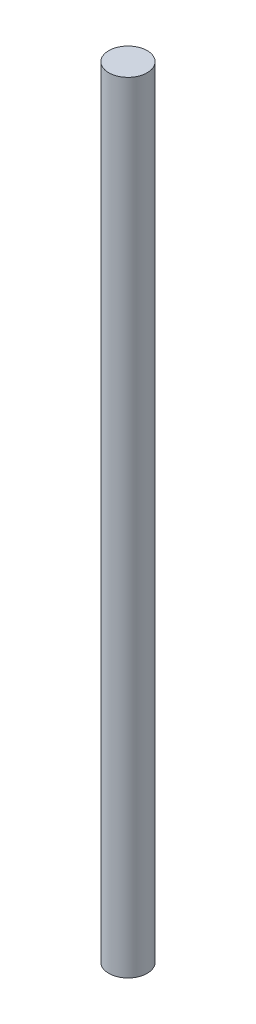
ISO-10303-21;
HEADER;
FILE_DESCRIPTION(('STEP AP214'),'2;1');
FILE_NAME('part.step','',(''),(''),'','','');
FILE_SCHEMA(('AUTOMOTIVE_DESIGN { 1 0 10303 214 1 1 1 1 }'));
ENDSEC;
DATA;
#1=APPLICATION_CONTEXT('core data for automotive mechanical design processes');
#2=APPLICATION_PROTOCOL_DEFINITION('international standard','automotive_design',2000,#1);
#3=PRODUCT_CONTEXT('',#1,'mechanical');
#4=PRODUCT('Part','Part','',(#3));
#5=PRODUCT_RELATED_PRODUCT_CATEGORY('part','',(#4));
#6=PRODUCT_DEFINITION_FORMATION('','',#4);
#7=PRODUCT_DEFINITION_CONTEXT('part definition',#1,'design');
#8=PRODUCT_DEFINITION('design','',#6,#7);
#9=PRODUCT_DEFINITION_SHAPE('','',#8);
#10=(LENGTH_UNIT() NAMED_UNIT(*) SI_UNIT(.MILLI.,.METRE.));
#11=(NAMED_UNIT(*) PLANE_ANGLE_UNIT() SI_UNIT($,.RADIAN.));
#12=(NAMED_UNIT(*) SI_UNIT($,.STERADIAN.) SOLID_ANGLE_UNIT());
#13=UNCERTAINTY_MEASURE_WITH_UNIT(LENGTH_MEASURE(1.E-05),#10,'distance_accuracy_value','');
#14=(GEOMETRIC_REPRESENTATION_CONTEXT(3) GLOBAL_UNCERTAINTY_ASSIGNED_CONTEXT((#13)) GLOBAL_UNIT_ASSIGNED_CONTEXT((#10,
#11,#12)) REPRESENTATION_CONTEXT('',''));
#15=CARTESIAN_POINT('',(0.,0.,0.));
#16=DIRECTION('',(0.,0.,1.));
#17=DIRECTION('',(1.,0.,0.));
#18=AXIS2_PLACEMENT_3D('',#15,#16,#17);
#19=CARTESIAN_POINT('',(0.,99.568,0.));
#20=DIRECTION('',(0.,-1.,0.));
#21=DIRECTION('',(0.,0.,-1.));
#22=AXIS2_PLACEMENT_3D('',#19,#20,#21);
#23=CYLINDRICAL_SURFACE('',#22,2.4511);
#24=CARTESIAN_POINT('',(0.,99.568,0.));
#25=DIRECTION('',(0.,1.,0.));
#26=DIRECTION('',(0.,0.,1.));
#27=AXIS2_PLACEMENT_3D('',#24,#25,#26);
#28=CIRCLE('',#27,2.4511);
#29=CARTESIAN_POINT('',(0.,99.568,2.4511));
#30=VERTEX_POINT('',#29);
#31=EDGE_CURVE('E10',#30,#30,#28,.T.);
#32=ORIENTED_EDGE('',*,*,#31,.F.);
#33=EDGE_LOOP('',(#32));
#34=FACE_BOUND('',#33,.T.);
#35=CARTESIAN_POINT('',(0.,0.,0.));
#36=DIRECTION('',(0.,1.,0.));
#37=DIRECTION('',(0.,0.,1.));
#38=AXIS2_PLACEMENT_3D('',#35,#36,#37);
#39=CIRCLE('',#38,2.4511);
#40=CARTESIAN_POINT('',(0.,0.,2.4511));
#41=VERTEX_POINT('',#40);
#42=EDGE_CURVE('E34',#41,#41,#39,.T.);
#43=ORIENTED_EDGE('',*,*,#42,.T.);
#44=EDGE_LOOP('',(#43));
#45=FACE_BOUND('',#44,.T.);
#46=ADVANCED_FACE('F31',(#34,#45),#23,.T.);
#47=CARTESIAN_POINT('',(0.,99.568,0.));
#48=DIRECTION('',(0.,1.,0.));
#49=DIRECTION('',(0.,0.,1.));
#50=AXIS2_PLACEMENT_3D('',#47,#48,#49);
#51=PLANE('',#50);
#52=ORIENTED_EDGE('',*,*,#31,.T.);
#53=EDGE_LOOP('',(#52));
#54=FACE_BOUND('',#53,.T.);
#55=ADVANCED_FACE('F46',(#54),#51,.T.);
#56=CARTESIAN_POINT('',(0.,0.,0.));
#57=DIRECTION('',(0.,1.,0.));
#58=DIRECTION('',(0.,0.,1.));
#59=AXIS2_PLACEMENT_3D('',#56,#57,#58);
#60=PLANE('',#59);
#61=ORIENTED_EDGE('',*,*,#42,.F.);
#62=EDGE_LOOP('',(#61));
#63=FACE_BOUND('',#62,.T.);
#64=ADVANCED_FACE('F44',(#63),#60,.F.);
#65=CLOSED_SHELL('',(#46,#55,#64));
#66=MANIFOLD_SOLID_BREP('B2',#65);
#67=ADVANCED_BREP_SHAPE_REPRESENTATION('',(#18,#66),#14);
#68=SHAPE_DEFINITION_REPRESENTATION(#9,#67);
ENDSEC;
END-ISO-10303-21;
